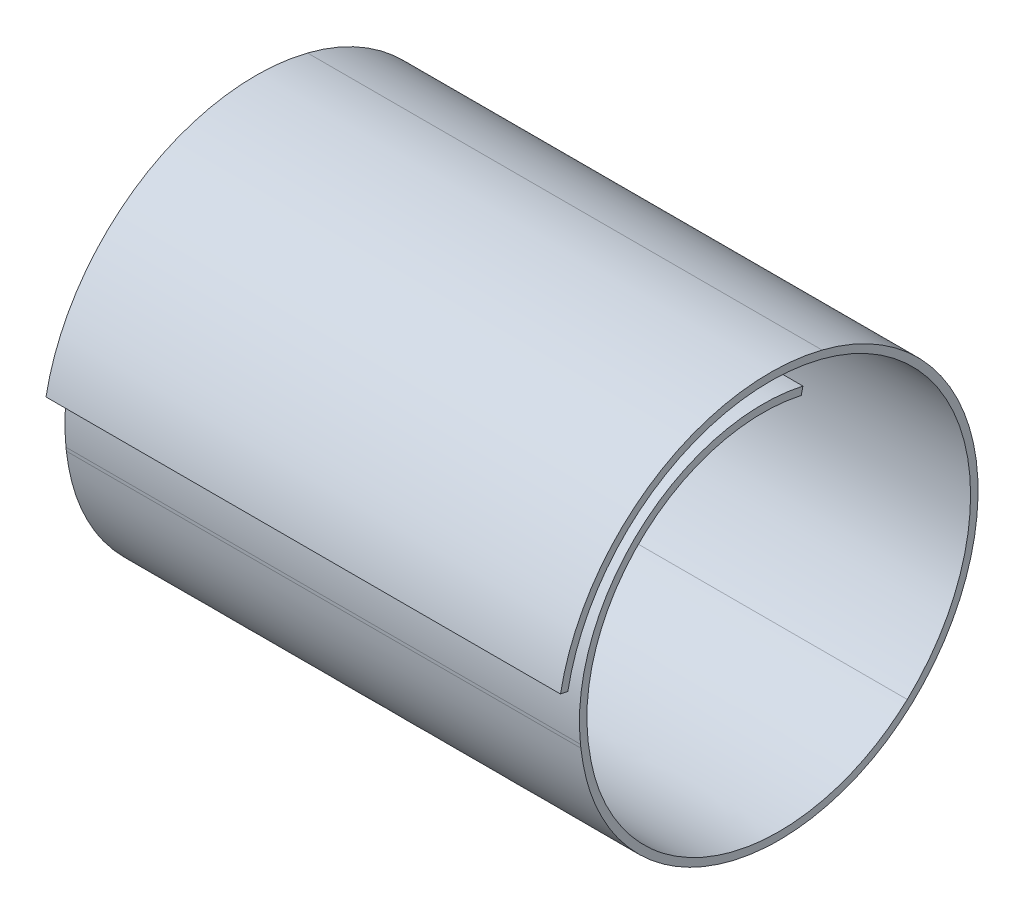
ISO-10303-21;
HEADER;
FILE_DESCRIPTION(('STEP AP214'),'2;1');
FILE_NAME('part.step','',(''),(''),'','','');
FILE_SCHEMA(('AUTOMOTIVE_DESIGN { 1 0 10303 214 1 1 1 1 }'));
ENDSEC;
DATA;
#1=APPLICATION_CONTEXT('core data for automotive mechanical design processes');
#2=APPLICATION_PROTOCOL_DEFINITION('international standard','automotive_design',2000,#1);
#3=PRODUCT_CONTEXT('',#1,'mechanical');
#4=PRODUCT('Part','Part','',(#3));
#5=PRODUCT_RELATED_PRODUCT_CATEGORY('part','',(#4));
#6=PRODUCT_DEFINITION_FORMATION('','',#4);
#7=PRODUCT_DEFINITION_CONTEXT('part definition',#1,'design');
#8=PRODUCT_DEFINITION('design','',#6,#7);
#9=PRODUCT_DEFINITION_SHAPE('','',#8);
#10=(LENGTH_UNIT() NAMED_UNIT(*) SI_UNIT(.MILLI.,.METRE.));
#11=(NAMED_UNIT(*) PLANE_ANGLE_UNIT() SI_UNIT($,.RADIAN.));
#12=(NAMED_UNIT(*) SI_UNIT($,.STERADIAN.) SOLID_ANGLE_UNIT());
#13=UNCERTAINTY_MEASURE_WITH_UNIT(LENGTH_MEASURE(1.E-05),#10,'distance_accuracy_value','');
#14=(GEOMETRIC_REPRESENTATION_CONTEXT(3) GLOBAL_UNCERTAINTY_ASSIGNED_CONTEXT((#13)) GLOBAL_UNIT_ASSIGNED_CONTEXT((#10,
#11,#12)) REPRESENTATION_CONTEXT('',''));
#15=CARTESIAN_POINT('',(0.,0.,0.));
#16=DIRECTION('',(0.,0.,1.));
#17=DIRECTION('',(1.,0.,0.));
#18=AXIS2_PLACEMENT_3D('',#15,#16,#17);
#19=CARTESIAN_POINT('',(22.2834841720338,32.5817594490575,-1.39727762361172));
#20=DIRECTION('',(1.,0.,0.));
#21=DIRECTION('',(0.,0.249377833365716,-0.968406266102105));
#22=AXIS2_PLACEMENT_3D('',#19,#20,#21);
#23=PLANE('',#22);
#24=CARTESIAN_POINT('',(22.2834841720338,32.0777337419169,0.56));
#25=DIRECTION('',(1.,0.,0.));
#26=DIRECTION('',(0.,0.249377833365716,-0.968406266102105));
#27=AXIS2_PLACEMENT_3D('',#24,#25,#26);
#28=CIRCLE('',#27,0.55);
#29=CARTESIAN_POINT('',(22.2834841720338,32.6112860792963,0.426501298594451));
#30=VERTEX_POINT('',#29);
#31=CARTESIAN_POINT('',(22.2834841720338,31.6749898063342,0.185370130756026));
#32=VERTEX_POINT('',#31);
#33=EDGE_CURVE('E11',#30,#32,#28,.F.);
#34=ORIENTED_EDGE('',*,*,#33,.T.);
#35=CARTESIAN_POINT('',(22.2834841720338,31.6749555199502,0.185339989653486));
#36=CARTESIAN_POINT('',(22.2834841720338,31.6698808621695,0.191012355613164));
#37=CARTESIAN_POINT('',(22.2834841720338,31.6648791742821,0.196751024358772));
#38=CARTESIAN_POINT('',(22.2834841720338,31.6550659642576,0.208393307895752));
#39=CARTESIAN_POINT('',(22.2834841720338,31.6502545398912,0.214297004897411));
#40=CARTESIAN_POINT('',(22.2834841720338,31.63618160218,0.232293075514867));
#41=CARTESIAN_POINT('',(22.2834841720338,31.6272793506486,0.244672680977374));
#42=CARTESIAN_POINT('',(22.2834841720338,31.6106773176507,0.270201987780066));
#43=CARTESIAN_POINT('',(22.2834841720338,31.6029766910361,0.283351138837553));
#44=CARTESIAN_POINT('',(22.2834841720338,31.5887690090579,0.310270247267101));
#45=CARTESIAN_POINT('',(22.2834841720338,31.5822617952751,0.324040121938613));
#46=CARTESIAN_POINT('',(22.2834841720338,31.5645509470875,0.366217417705972));
#47=CARTESIAN_POINT('',(22.2834841720338,31.5551995971211,0.395428061956361));
#48=CARTESIAN_POINT('',(22.2834841720338,31.5416568440759,0.454995892258565));
#49=CARTESIAN_POINT('',(22.2834841720338,31.5374638957613,0.485352732149487));
#50=CARTESIAN_POINT('',(22.2834841720338,31.5344775086547,0.54543933930613));
#51=CARTESIAN_POINT('',(22.2834841720338,31.5355289374535,0.575161300786628));
#52=CARTESIAN_POINT('',(22.2834841720338,31.5426069670161,0.634007862933464));
#53=CARTESIAN_POINT('',(22.2834841720338,31.5486342274763,0.663132383866301));
#54=CARTESIAN_POINT('',(22.2834841720338,31.565450483892,0.719893215268894));
#55=CARTESIAN_POINT('',(22.2834841720338,31.5762278726637,0.747532970274621));
#56=CARTESIAN_POINT('',(22.2834841720338,31.6022035456812,0.800650688975554));
#57=CARTESIAN_POINT('',(22.2834841720338,31.6174018825885,0.826128626914995));
#58=CARTESIAN_POINT('',(22.2834841720338,31.6520475525597,0.874485353006531));
#59=CARTESIAN_POINT('',(22.2834841720338,31.671544104786,0.897328935122091));
#60=CARTESIAN_POINT('',(22.2834841720338,31.7141097676822,0.939408236840575));
#61=CARTESIAN_POINT('',(22.2834841720338,31.7371799151115,0.958642905845451));
#62=CARTESIAN_POINT('',(22.2834841720338,31.7862010846961,0.993091464107349));
#63=CARTESIAN_POINT('',(22.2834841720338,31.8121573684555,1.00829783307192));
#64=CARTESIAN_POINT('',(22.2834841720338,31.8662539140428,1.03416566235308));
#65=CARTESIAN_POINT('',(22.2834841720338,31.8943921679861,1.0448312438594));
#66=CARTESIAN_POINT('',(22.2834841720338,31.9379021349199,1.05701358314625));
#67=CARTESIAN_POINT('',(22.2834841720338,31.9527621090303,1.06045145471141));
#68=CARTESIAN_POINT('',(22.2834841720338,31.9826703304152,1.06622344208677));
#69=CARTESIAN_POINT('',(22.2834841720338,31.9977181886181,1.06855954269358));
#70=CARTESIAN_POINT('',(22.2834841720338,32.0128022203996,1.07047103077814));
#71=B_SPLINE_CURVE_WITH_KNOTS('',3,(#35,#36,#37,#38,#39,#40,#41,#42,#43,#44,#45,#46,#47,#48,#49,
#50,#51,#52,#53,#54,#55,#56,#57,#58,#59,#60,#61,#62,#63,#64,#65,#66,#67,#68,#69,#70),
.UNSPECIFIED.,.F.,.F.,(4,2,2,2,2,2,2,2,2,2,2,2,2,2,2,2,2,4),(0.,0.0228330582740365,
0.045677701196849,0.0913578260237418,0.137005676057433,0.182647462186725,0.274157819941521,
0.365640758440238,0.454433902441009,0.543238820539437,0.631827932008516,0.720418098775036,
0.810080925523775,0.899769813838889,0.989624977707331,1.07939841484562,1.12511416775738,
1.17074724798271),.UNSPECIFIED.);
#72=CARTESIAN_POINT('',(22.2834841720338,32.0128085285747,1.07042176268635));
#73=VERTEX_POINT('',#72);
#74=EDGE_CURVE('E270',#32,#73,#71,.T.);
#75=ORIENTED_EDGE('',*,*,#74,.T.);
#76=CARTESIAN_POINT('',(22.2834841720338,32.0128150240828,1.07037252638147));
#77=CARTESIAN_POINT('',(22.2834841720338,32.0159557298064,1.07071470129051));
#78=CARTESIAN_POINT('',(22.2834841720338,32.01909643553,1.07105687619956));
#79=CARTESIAN_POINT('',(22.2834841720338,32.0222371412536,1.07139905110861));
#80=B_SPLINE_CURVE_WITH_KNOTS('',3,(#76,#77,#78,#79),.UNSPECIFIED.,.F.,.F.,(4,4),(0.,1.),.UNSPECIFIED.);
#81=CARTESIAN_POINT('',(22.2834843387005,32.0222369755674,1.07139903305735));
#82=VERTEX_POINT('',#81);
#83=EDGE_CURVE('E189',#73,#82,#80,.T.);
#84=ORIENTED_EDGE('',*,*,#83,.T.);
#85=CARTESIAN_POINT('',(22.2834841720338,32.0753078344884,0.584281423276168));
#86=DIRECTION('',(1.,0.,0.));
#87=DIRECTION('',(0.,0.782950168785445,0.622084426102152));
#88=AXIS2_PLACEMENT_3D('',#85,#86,#87);
#89=CIRCLE('',#88,0.49);
#90=CARTESIAN_POINT('',(22.2834841720338,32.5535587850281,0.477622957565097));
#91=VERTEX_POINT('',#90);
#92=EDGE_CURVE('E391',#82,#91,#89,.F.);
#93=ORIENTED_EDGE('',*,*,#92,.T.);
#94=CARTESIAN_POINT('',(22.2834841720338,32.5340383380673,0.481976364328814));
#95=CARTESIAN_POINT('',(22.2834841720338,32.5405451537209,0.480525228740909));
#96=CARTESIAN_POINT('',(22.2834841720338,32.5470519693745,0.479074093153006));
#97=CARTESIAN_POINT('',(22.2834841720338,32.5535587850281,0.477622957565097));
#98=B_SPLINE_CURVE_WITH_KNOTS('',3,(#94,#95,#96,#97),.UNSPECIFIED.,.F.,.F.,(4,4),(0.,1.),.UNSPECIFIED.);
#99=CARTESIAN_POINT('',(22.2834844220338,32.5340383380673,0.481976364328814));
#100=VERTEX_POINT('',#99);
#101=EDGE_CURVE('E396',#100,#91,#98,.T.);
#102=ORIENTED_EDGE('',*,*,#101,.F.);
#103=CARTESIAN_POINT('',(22.2834841720338,32.0753078344884,0.584281423276168));
#104=DIRECTION('',(1.,0.,0.));
#105=DIRECTION('',(0.,0.782950168785445,0.622084426102152));
#106=AXIS2_PLACEMENT_3D('',#103,#104,#105);
#107=CIRCLE('',#106,0.47);
#108=CARTESIAN_POINT('',(22.2834841720338,32.0244032735784,1.05151686801847));
#109=VERTEX_POINT('',#108);
#110=EDGE_CURVE('E380',#109,#100,#107,.F.);
#111=ORIENTED_EDGE('',*,*,#110,.F.);
#112=CARTESIAN_POINT('',(22.2834841720338,32.0146341267692,1.05045236731752));
#113=CARTESIAN_POINT('',(22.2834841720338,32.0178905150558,1.05080714565839));
#114=CARTESIAN_POINT('',(22.2834841720338,32.0211469033423,1.05116192399925));
#115=CARTESIAN_POINT('',(22.2834841720338,32.0244032916288,1.05151670234011));
#116=B_SPLINE_CURVE_WITH_KNOTS('',3,(#112,#113,#114,#115),.UNSPECIFIED.,.F.,.F.,(4,4),(0.,1.),.UNSPECIFIED.);
#117=CARTESIAN_POINT('',(22.2834841720338,32.0146281301622,1.05049788347525));
#118=VERTEX_POINT('',#117);
#119=EDGE_CURVE('E171',#118,#109,#116,.T.);
#120=ORIENTED_EDGE('',*,*,#119,.F.);
#121=CARTESIAN_POINT('',(22.2834841720338,31.689612803697,0.198955729521763));
#122=CARTESIAN_POINT('',(22.2834841720338,31.6847336601493,0.20440555265611));
#123=CARTESIAN_POINT('',(22.2834841720338,31.6799229697497,0.209917971215753));
#124=CARTESIAN_POINT('',(22.2834841720338,31.6704850843375,0.221101878385132));
#125=CARTESIAN_POINT('',(22.2834841720338,31.6658579793595,0.226773442771875));
#126=CARTESIAN_POINT('',(22.2834841720338,31.652331705133,0.244066302985727));
#127=CARTESIAN_POINT('',(22.2834841720338,31.6437846176428,0.255968968828372));
#128=CARTESIAN_POINT('',(22.2834841720338,31.6278422718934,0.28050921325994));
#129=CARTESIAN_POINT('',(22.2834841720338,31.6204461369596,0.293146222326122));
#130=CARTESIAN_POINT('',(22.2834841720338,31.6067891477932,0.319012427695709));
#131=CARTESIAN_POINT('',(22.2834841720338,31.6005282363531,0.332241594116433));
#132=CARTESIAN_POINT('',(22.2834841720338,31.5834830157649,0.372764355323607));
#133=CARTESIAN_POINT('',(22.2834841720338,31.574476356244,0.400830931621634));
#134=CARTESIAN_POINT('',(22.2834841720338,31.5614402520262,0.458072270953598));
#135=CARTESIAN_POINT('',(22.2834841720338,31.5574094328045,0.487246725651107));
#136=CARTESIAN_POINT('',(22.2834841720338,31.5545241532531,0.544935037793491));
#137=CARTESIAN_POINT('',(22.2834841720338,31.5555114288369,0.573440944271861));
#138=CARTESIAN_POINT('',(22.2834841720338,31.5622365029683,0.629926321896197));
#139=CARTESIAN_POINT('',(22.2834841720338,31.5679810601765,0.657904986117068));
#140=CARTESIAN_POINT('',(22.2834841720338,31.5840735105387,0.712527069755707));
#141=CARTESIAN_POINT('',(22.2834841720338,31.5944248208265,0.739169481633073));
#142=CARTESIAN_POINT('',(22.2834841720338,31.6193998134761,0.790366212943047));
#143=CARTESIAN_POINT('',(22.2834841720338,31.6340231877667,0.814920682778638));
#144=CARTESIAN_POINT('',(22.2834841720338,31.6673367119266,0.861507610466049));
#145=CARTESIAN_POINT('',(22.2834841720338,31.6860695517594,0.883509579870706));
#146=CARTESIAN_POINT('',(22.2834841720338,31.7269425866779,0.924021281961485));
#147=CARTESIAN_POINT('',(22.2834841720338,31.7490785081434,0.942535330793605));
#148=CARTESIAN_POINT('',(22.2834841720338,31.7961811543727,0.97572428543135));
#149=CARTESIAN_POINT('',(22.2834841720338,31.8211586388741,0.990383852596585));
#150=CARTESIAN_POINT('',(22.2834841720338,31.8732117068689,1.01534684127488));
#151=CARTESIAN_POINT('',(22.2834841720338,31.9002854766614,1.0256539797462));
#152=CARTESIAN_POINT('',(22.2834841720338,31.942214655206,1.03747723103188));
#153=CARTESIAN_POINT('',(22.2834841720338,31.9565768782218,1.04082803809299));
#154=CARTESIAN_POINT('',(22.2834841720338,31.9854876204645,1.04644258178711));
#155=CARTESIAN_POINT('',(22.2834841720338,32.0000357448822,1.04870832254806));
#156=CARTESIAN_POINT('',(22.2834841720338,32.0146222989028,1.0505434201971));
#157=B_SPLINE_CURVE_WITH_KNOTS('',3,(#121,#122,#123,#124,#125,#126,#127,#128,#129,#130,#131,
#132,#133,#134,#135,#136,#137,#138,#139,#140,#141,#142,#143,#144,#145,#146,#147,#148,#149,#150,
#151,#152,#153,#154,#155,#156),.UNSPECIFIED.,.F.,.F.,(4,2,2,2,2,2,2,2,2,2,2,2,2,2,2,2,2,4),(0.,
0.0219448502578412,0.0439003330174963,0.0877982517423902,0.131662568231541,0.175524673638027,
0.263468125582214,0.351387278611099,0.436551115885536,0.52183615324023,0.607184557868231,
0.692526809285057,0.778801557396353,0.864968832836049,0.951473985758361,1.03790511345535,
1.08210746755155,1.12622786155224),.UNSPECIFIED.);
#158=CARTESIAN_POINT('',(22.2834841720338,31.6896362433948,0.198993591413968));
#159=VERTEX_POINT('',#158);
#160=EDGE_CURVE('E257',#159,#118,#157,.T.);
#161=ORIENTED_EDGE('',*,*,#160,.F.);
#162=CARTESIAN_POINT('',(22.2834841720338,32.0777337419169,0.56));
#163=DIRECTION('',(1.,0.,0.));
#164=DIRECTION('',(0.,0.249377833365716,-0.968406266102105));
#165=AXIS2_PLACEMENT_3D('',#162,#163,#164);
#166=CIRCLE('',#165,0.53);
#167=CARTESIAN_POINT('',(22.2834841720338,32.591884419122,0.431355736026203));
#168=VERTEX_POINT('',#167);
#169=EDGE_CURVE('E64',#168,#159,#166,.F.);
#170=ORIENTED_EDGE('',*,*,#169,.F.);
#171=CARTESIAN_POINT('',(22.2834841720338,32.0583318387619,0.564854498227317));
#172=DIRECTION('',(1.,0.,0.));
#173=DIRECTION('',(0.,0.814602386089999,0.580019786366362));
#174=AXIS2_PLACEMENT_3D('',#171,#172,#173);
#175=CIRCLE('',#174,0.55);
#176=CARTESIAN_POINT('',(22.2834841720338,32.1613807466414,1.10511454911471));
#177=VERTEX_POINT('',#176);
#178=EDGE_CURVE('E152',#177,#168,#175,.F.);
#179=ORIENTED_EDGE('',*,*,#178,.F.);
#180=CARTESIAN_POINT('',(22.2834841720338,32.1613807466414,1.10511454911471));
#181=CARTESIAN_POINT('',(22.2834841720338,32.1626298243126,1.11166315579218));
#182=CARTESIAN_POINT('',(22.2834841720338,32.1638789019839,1.11821176246953));
#183=CARTESIAN_POINT('',(22.2834841720338,32.1651279796552,1.12476036914697));
#184=B_SPLINE_CURVE_WITH_KNOTS('',3,(#180,#181,#182,#183),.UNSPECIFIED.,.F.,.F.,(4,4),(0.,
2.E-05),.UNSPECIFIED.);
#185=CARTESIAN_POINT('',(22.2834841720338,32.1651279796552,1.12476036914697));
#186=VERTEX_POINT('',#185);
#187=EDGE_CURVE('E150',#177,#186,#184,.T.);
#188=ORIENTED_EDGE('',*,*,#187,.T.);
#189=CARTESIAN_POINT('',(22.2834841720338,32.0583318387619,0.564854498227317));
#190=DIRECTION('',(1.,0.,0.));
#191=DIRECTION('',(0.,0.814602386089999,0.580019786366362));
#192=AXIS2_PLACEMENT_3D('',#189,#190,#191);
#193=CIRCLE('',#192,0.57);
#194=EDGE_CURVE('E139',#186,#30,#193,.F.);
#195=ORIENTED_EDGE('',*,*,#194,.T.);
#196=EDGE_LOOP('',(#34,#75,#84,#93,#102,#111,#120,#161,#170,#179,#188,#195));
#197=FACE_BOUND('',#196,.T.);
#198=ADVANCED_FACE('F45',(#197),#23,.F.);
#199=CARTESIAN_POINT('',(23.6569362608721,31.576333585848,2.50708184929005));
#200=DIRECTION('',(1.,0.,0.));
#201=DIRECTION('',(0.,0.249377833365716,-0.968406266102105));
#202=AXIS2_PLACEMENT_3D('',#199,#200,#201);
#203=PLANE('',#202);
#204=CARTESIAN_POINT('',(23.6569362608721,32.0777337419169,0.56));
#205=DIRECTION('',(1.,0.,0.));
#206=DIRECTION('',(0.,0.249377833365716,-0.968406266102105));
#207=AXIS2_PLACEMENT_3D('',#204,#205,#206);
#208=CIRCLE('',#207,0.53);
#209=CARTESIAN_POINT('',(23.6569362608721,31.6896362433949,0.198993591413992));
#210=VERTEX_POINT('',#209);
#211=CARTESIAN_POINT('',(23.6569362608721,32.5918841761189,0.431355796827378));
#212=VERTEX_POINT('',#211);
#213=EDGE_CURVE('E56',#210,#212,#208,.T.);
#214=ORIENTED_EDGE('',*,*,#213,.F.);
#215=CARTESIAN_POINT('',(23.6569362608721,32.0146225468537,1.05054345194875));
#216=CARTESIAN_POINT('',(23.6569362608721,32.0071313689948,1.04958101969867));
#217=CARTESIAN_POINT('',(23.6569362608721,31.9996517424406,1.0485229792424));
#218=CARTESIAN_POINT('',(23.6569362608721,31.9847274643348,1.0461624410444));
#219=CARTESIAN_POINT('',(23.6569362608721,31.9772828330721,1.04485981601913));
#220=CARTESIAN_POINT('',(23.6569362608721,31.9550339824158,1.04050732136163));
#221=CARTESIAN_POINT('',(23.6569362608721,31.9403117673156,1.03701248594652));
#222=CARTESIAN_POINT('',(23.6569362608721,31.9112605904953,1.02866056189237));
#223=CARTESIAN_POINT('',(23.6569362608721,31.896931560437,1.02380371164791));
#224=CARTESIAN_POINT('',(23.6569362608721,31.8687660896442,1.01284439662159));
#225=CARTESIAN_POINT('',(23.6569362608721,31.8549296084438,1.00674203444478));
#226=CARTESIAN_POINT('',(23.6569362608721,31.8142105720938,0.986595982054203));
#227=CARTESIAN_POINT('',(23.6569362608721,31.7881994805824,0.970737014914492));
#228=CARTESIAN_POINT('',(23.6569362608721,31.7393475472495,0.934761226504578));
#229=CARTESIAN_POINT('',(23.6569362608721,31.7165051801357,0.914646465654118));
#230=CARTESIAN_POINT('',(23.6569362608721,31.6755879834309,0.871548453723236));
#231=CARTESIAN_POINT('',(23.6569362608721,31.6573596750748,0.848711100846284));
#232=CARTESIAN_POINT('',(23.6569362608721,31.6250405273983,0.800275083581147));
#233=CARTESIAN_POINT('',(23.6569362608721,31.6109500778657,0.774676159362399));
#234=CARTESIAN_POINT('',(23.6569362608721,31.5874719149764,0.72180270757544));
#235=CARTESIAN_POINT('',(23.6569362608721,31.5780255721804,0.694554221693799));
#236=CARTESIAN_POINT('',(23.6569362608721,31.5638722110155,0.63885507027403));
#237=CARTESIAN_POINT('',(23.6569362608721,31.5591645322949,0.610404572816892));
#238=CARTESIAN_POINT('',(23.6569362608721,31.5546385648387,0.553214671541562));
#239=CARTESIAN_POINT('',(23.6569362608721,31.5548037472893,0.524476574853853));
#240=CARTESIAN_POINT('',(23.6569362608721,31.5599951693226,0.46744454585484));
#241=CARTESIAN_POINT('',(23.6569362608721,31.5650207416896,0.439150553120406));
#242=CARTESIAN_POINT('',(23.6569362608721,31.5797278252537,0.383970356372632));
#243=CARTESIAN_POINT('',(23.6569362608721,31.5893844458516,0.357077468701239));
#244=CARTESIAN_POINT('',(23.6569362608721,31.6131021017867,0.305305834291584));
#245=CARTESIAN_POINT('',(23.6569362608721,31.6271583401041,0.280424930836879));
#246=CARTESIAN_POINT('',(23.6569362608721,31.6503565792303,0.246827212339497));
#247=CARTESIAN_POINT('',(23.6569362608721,31.657802312192,0.236904740042403));
#248=CARTESIAN_POINT('',(23.6569362608721,31.6732974308587,0.217571134457194));
#249=CARTESIAN_POINT('',(23.6569362608721,31.6813456482391,0.208159069564563));
#250=CARTESIAN_POINT('',(23.6569362608721,31.6896126983223,0.198955847142111));
#251=B_SPLINE_CURVE_WITH_KNOTS('',3,(#215,#216,#217,#218,#219,#220,#221,#222,#223,#224,#225,
#226,#227,#228,#229,#230,#231,#232,#233,#234,#235,#236,#237,#238,#239,#240,#241,#242,#243,#244,
#245,#246,#247,#248,#249,#250),.UNSPECIFIED.,.F.,.F.,(4,2,2,2,2,2,2,2,2,2,2,2,2,2,2,2,2,4),(0.,
0.0226581640643217,0.0453281524435603,0.0906589763575372,0.135981870926543,0.181301033309154,
0.272189195921178,0.363033455797144,0.450264762666705,0.537504284120404,0.623612203195223,
0.709708121129149,0.795512034181931,0.881304170072077,0.966640278572082,1.05188366507497,
1.08907577788888,1.12619754911163),.UNSPECIFIED.);
#252=CARTESIAN_POINT('',(23.6569362608721,32.0146283783759,1.05049791306769));
#253=VERTEX_POINT('',#252);
#254=EDGE_CURVE('E195',#253,#210,#251,.T.);
#255=ORIENTED_EDGE('',*,*,#254,.F.);
#256=CARTESIAN_POINT('',(23.6569362608721,32.0244032916288,1.05151670234011));
#257=CARTESIAN_POINT('',(23.6569362608721,32.0211469033423,1.05116192399925));
#258=CARTESIAN_POINT('',(23.6569362608721,32.0178905150558,1.05080714565839));
#259=CARTESIAN_POINT('',(23.6569362608721,32.0146341267692,1.05045236731752));
#260=B_SPLINE_CURVE_WITH_KNOTS('',3,(#256,#257,#258,#259),.UNSPECIFIED.,.F.,.F.,(4,4),(0.,1.),.UNSPECIFIED.);
#261=CARTESIAN_POINT('',(23.6569362608721,32.0244032916288,1.05151670234011));
#262=VERTEX_POINT('',#261);
#263=EDGE_CURVE('E173',#262,#253,#260,.T.);
#264=ORIENTED_EDGE('',*,*,#263,.F.);
#265=CARTESIAN_POINT('',(23.6569362608721,32.0753078344884,0.584281423276168));
#266=DIRECTION('',(1.,0.,0.));
#267=DIRECTION('',(0.,0.782950168785445,0.622084426102152));
#268=AXIS2_PLACEMENT_3D('',#265,#266,#267);
#269=CIRCLE('',#268,0.47);
#270=CARTESIAN_POINT('',(23.6569362608721,32.5340383380673,0.48197636432881));
#271=VERTEX_POINT('',#270);
#272=EDGE_CURVE('E388',#271,#262,#269,.T.);
#273=ORIENTED_EDGE('',*,*,#272,.F.);
#274=CARTESIAN_POINT('',(23.6569362608721,32.5535587850281,0.477622957565094));
#275=CARTESIAN_POINT('',(23.6569362608721,32.5470519693745,0.479074093153014));
#276=CARTESIAN_POINT('',(23.6569362608721,32.5405451537209,0.4805252287409));
#277=CARTESIAN_POINT('',(23.6569362608721,32.5340383380673,0.48197636432881));
#278=B_SPLINE_CURVE_WITH_KNOTS('',3,(#274,#275,#276,#277),.UNSPECIFIED.,.F.,.F.,(4,4),(-2.E-05,
0.),.UNSPECIFIED.);
#279=CARTESIAN_POINT('',(23.6569362608721,32.5535587850281,0.477622957565094));
#280=VERTEX_POINT('',#279);
#281=EDGE_CURVE('E184',#271,#280,#278,.F.);
#282=ORIENTED_EDGE('',*,*,#281,.T.);
#283=CARTESIAN_POINT('',(23.6569362608721,32.0753078344884,0.584281423276168));
#284=DIRECTION('',(1.,0.,0.));
#285=DIRECTION('',(0.,0.782950168785445,0.622084426102152));
#286=AXIS2_PLACEMENT_3D('',#283,#284,#285);
#287=CIRCLE('',#286,0.49);
#288=CARTESIAN_POINT('',(23.6569362608721,32.0222369755674,1.07139903305735));
#289=VERTEX_POINT('',#288);
#290=EDGE_CURVE('E326',#289,#280,#287,.F.);
#291=ORIENTED_EDGE('',*,*,#290,.F.);
#292=CARTESIAN_POINT('',(23.6569362608721,32.0128150240828,1.07037252638147));
#293=CARTESIAN_POINT('',(23.6569362608721,32.0159557298064,1.07071470129051));
#294=CARTESIAN_POINT('',(23.6569362608721,32.01909643553,1.07105687619956));
#295=CARTESIAN_POINT('',(23.6569362608721,32.0222371412536,1.07139905110861));
#296=B_SPLINE_CURVE_WITH_KNOTS('',3,(#292,#293,#294,#295),.UNSPECIFIED.,.F.,.F.,(4,4),(0.,1.),.UNSPECIFIED.);
#297=CARTESIAN_POINT('',(23.6569362608721,32.0128085285747,1.07042176268638));
#298=VERTEX_POINT('',#297);
#299=EDGE_CURVE('E319',#298,#289,#296,.T.);
#300=ORIENTED_EDGE('',*,*,#299,.F.);
#301=CARTESIAN_POINT('',(23.6569362608721,31.6749555199503,0.185339989653518));
#302=CARTESIAN_POINT('',(23.6569362608721,31.6698808621696,0.191012355613193));
#303=CARTESIAN_POINT('',(23.6569362608721,31.6648791742821,0.1967510243588));
#304=CARTESIAN_POINT('',(23.6569362608721,31.6550659642577,0.208393307895783));
#305=CARTESIAN_POINT('',(23.6569362608721,31.6502545398913,0.214297004897445));
#306=CARTESIAN_POINT('',(23.6569362608721,31.63618160218,0.232293075514896));
#307=CARTESIAN_POINT('',(23.6569362608721,31.6272793506486,0.244672680977388));
#308=CARTESIAN_POINT('',(23.6569362608721,31.6106773176507,0.270201987780075));
#309=CARTESIAN_POINT('',(23.6569362608721,31.602976691036,0.283351138837574));
#310=CARTESIAN_POINT('',(23.6569362608721,31.5887690090578,0.310270247267143));
#311=CARTESIAN_POINT('',(23.6569362608721,31.582261795275,0.324040121938665));
#312=CARTESIAN_POINT('',(23.6569362608721,31.5645509470874,0.366217417706049));
#313=CARTESIAN_POINT('',(23.6569362608721,31.5551995971211,0.395428061956451));
#314=CARTESIAN_POINT('',(23.6569362608721,31.5416568440759,0.454995892258683));
#315=CARTESIAN_POINT('',(23.6569362608721,31.5374638957613,0.485352732149621));
#316=CARTESIAN_POINT('',(23.6569362608721,31.5344775086547,0.545439339306328));
#317=CARTESIAN_POINT('',(23.6569362608721,31.5355289374535,0.575161300786875));
#318=CARTESIAN_POINT('',(23.6569362608721,31.5426069670161,0.634007862933811));
#319=CARTESIAN_POINT('',(23.6569362608721,31.5486342274764,0.663132383866696));
#320=CARTESIAN_POINT('',(23.6569362608721,31.5654504838921,0.719893215269326));
#321=CARTESIAN_POINT('',(23.6569362608721,31.5762278726639,0.747532970275043));
#322=CARTESIAN_POINT('',(23.6569362608721,31.6022035456815,0.800650688975963));
#323=CARTESIAN_POINT('',(23.6569362608721,31.6174018825887,0.8261286269154));
#324=CARTESIAN_POINT('',(23.6569362608721,31.65204755256,0.874485353006931));
#325=CARTESIAN_POINT('',(23.6569362608721,31.6715441047864,0.897328935122489));
#326=CARTESIAN_POINT('',(23.6569362608721,31.7141097676826,0.939408236840947));
#327=CARTESIAN_POINT('',(23.6569362608721,31.7371799151119,0.958642905845797));
#328=CARTESIAN_POINT('',(23.6569362608721,31.7862010846965,0.993091464107602));
#329=CARTESIAN_POINT('',(23.6569362608721,31.8121573684559,1.00829783307211));
#330=CARTESIAN_POINT('',(23.6569362608721,31.8662539140432,1.0341656623532));
#331=CARTESIAN_POINT('',(23.6569362608721,31.8943921679864,1.0448312438595));
#332=CARTESIAN_POINT('',(23.6569362608721,31.9379021349202,1.05701358314634));
#333=CARTESIAN_POINT('',(23.6569362608721,31.9527621090305,1.0604514547115));
#334=CARTESIAN_POINT('',(23.6569362608721,31.9826703304153,1.06622344208685));
#335=CARTESIAN_POINT('',(23.6569362608721,31.9977181886181,1.06855954269366));
#336=CARTESIAN_POINT('',(23.6569362608721,32.0128022203996,1.0704710307782));
#337=B_SPLINE_CURVE_WITH_KNOTS('',3,(#301,#302,#303,#304,#305,#306,#307,#308,#309,#310,#311,
#312,#313,#314,#315,#316,#317,#318,#319,#320,#321,#322,#323,#324,#325,#326,#327,#328,#329,#330,
#331,#332,#333,#334,#335,#336),.UNSPECIFIED.,.F.,.F.,(4,2,2,2,2,2,2,2,2,2,2,2,2,2,2,2,2,4),(0.,
0.0228330582740425,0.0456777011968664,0.0913578260237786,0.137005676057491,0.182647462186803,
0.274157819941633,0.365640758440392,0.454433902441315,0.543238820539894,0.631827932008982,
0.720418098775525,0.810080925524309,0.899769813839457,0.989624977707764,1.07939841484591,
1.12511416775754,1.17074724798272),.UNSPECIFIED.);
#338=CARTESIAN_POINT('',(23.6569362608721,31.6749898063342,0.185370130756042));
#339=VERTEX_POINT('',#338);
#340=EDGE_CURVE('E269',#339,#298,#337,.T.);
#341=ORIENTED_EDGE('',*,*,#340,.F.);
#342=CARTESIAN_POINT('',(23.6569362608721,32.0777337419169,0.56));
#343=DIRECTION('',(1.,0.,0.));
#344=DIRECTION('',(0.,0.249377833365716,-0.968406266102105));
#345=AXIS2_PLACEMENT_3D('',#342,#343,#344);
#346=CIRCLE('',#345,0.55);
#347=CARTESIAN_POINT('',(23.6569362608721,32.6112860792963,0.426501298594451));
#348=VERTEX_POINT('',#347);
#349=EDGE_CURVE('E77',#348,#339,#346,.F.);
#350=ORIENTED_EDGE('',*,*,#349,.F.);
#351=CARTESIAN_POINT('',(23.6569362608721,32.0583318387619,0.564854498227317));
#352=DIRECTION('',(1.,0.,0.));
#353=DIRECTION('',(0.,0.814602386089999,0.580019786366362));
#354=AXIS2_PLACEMENT_3D('',#351,#352,#353);
#355=CIRCLE('',#354,0.57);
#356=CARTESIAN_POINT('',(23.6569362608721,32.1651279796552,1.12476036914697));
#357=VERTEX_POINT('',#356);
#358=EDGE_CURVE('E147',#357,#348,#355,.F.);
#359=ORIENTED_EDGE('',*,*,#358,.F.);
#360=CARTESIAN_POINT('',(23.6569362608721,32.1613807466414,1.10511454911471));
#361=CARTESIAN_POINT('',(23.6569362608721,32.1626298243126,1.11166315579218));
#362=CARTESIAN_POINT('',(23.6569362608721,32.1638789019839,1.11821176246953));
#363=CARTESIAN_POINT('',(23.6569362608721,32.1651279796552,1.12476036914697));
#364=B_SPLINE_CURVE_WITH_KNOTS('',3,(#360,#361,#362,#363),.UNSPECIFIED.,.F.,.F.,(4,4),(0.,
2.E-05),.UNSPECIFIED.);
#365=CARTESIAN_POINT('',(23.6569362608721,32.1613807466414,1.10511454911471));
#366=VERTEX_POINT('',#365);
#367=EDGE_CURVE('E156',#357,#366,#364,.F.);
#368=ORIENTED_EDGE('',*,*,#367,.T.);
#369=CARTESIAN_POINT('',(23.6569362608721,32.0583318387619,0.564854498227317));
#370=DIRECTION('',(1.,0.,0.));
#371=DIRECTION('',(0.,0.814602386089999,0.580019786366362));
#372=AXIS2_PLACEMENT_3D('',#369,#370,#371);
#373=CIRCLE('',#372,0.55);
#374=EDGE_CURVE('E169',#212,#366,#373,.T.);
#375=ORIENTED_EDGE('',*,*,#374,.F.);
#376=EDGE_LOOP('',(#214,#255,#264,#273,#282,#291,#300,#341,#350,#359,#368,#375));
#377=FACE_BOUND('',#376,.T.);
#378=ADVANCED_FACE('F324',(#377),#203,.T.);
#379=CARTESIAN_POINT('',(22.2834841715667,32.0777337419169,0.56));
#380=DIRECTION('',(1.,0.,0.));
#381=DIRECTION('',(0.,0.968406266102103,0.249377833365726));
#382=AXIS2_PLACEMENT_3D('',#379,#380,#381);
#383=CYLINDRICAL_SURFACE('',#382,0.53);
#384=CARTESIAN_POINT('',(23.7942814697559,31.6896049566283,0.198964488615709));
#385=CARTESIAN_POINT('',(23.244900634221,31.6896049566282,0.198964488615482));
#386=CARTESIAN_POINT('',(22.6955197986849,31.6896049566284,0.198964488615983));
#387=CARTESIAN_POINT('',(22.1461389631502,31.6896049566282,0.198964488615494));
#388=B_SPLINE_CURVE_WITH_KNOTS('',3,(#384,#385,#386,#387),.UNSPECIFIED.,.F.,.F.,(4,4),
(0.02214613896315,0.023794281469756),.UNSPECIFIED.);
#389=EDGE_CURVE('E328',#210,#159,#388,.T.);
#390=ORIENTED_EDGE('',*,*,#389,.F.);
#391=ORIENTED_EDGE('',*,*,#213,.T.);
#392=DIRECTION('',(1.,0.,0.));
#393=VECTOR('',#392,1.);
#394=CARTESIAN_POINT('',(23.8615664419416,32.5918841761413,0.431355796821773));
#395=LINE('',#394,#393);
#396=EDGE_CURVE('E160',#212,#168,#395,.F.);
#397=ORIENTED_EDGE('',*,*,#396,.T.);
#398=ORIENTED_EDGE('',*,*,#169,.T.);
#399=EDGE_LOOP('',(#390,#391,#397,#398));
#400=FACE_BOUND('',#399,.T.);
#401=ADVANCED_FACE('F419',(#400),#383,.F.);
#402=CARTESIAN_POINT('',(22.2834841715667,32.0777337419169,0.56));
#403=DIRECTION('',(1.,0.,0.));
#404=DIRECTION('',(0.,0.968406266102103,0.249377833365726));
#405=AXIS2_PLACEMENT_3D('',#402,#403,#404);
#406=CYLINDRICAL_SURFACE('',#405,0.55);
#407=ORIENTED_EDGE('',*,*,#349,.T.);
#408=CARTESIAN_POINT('',(22.14613896315,31.6749566610453,0.185338715194003));
#409=CARTESIAN_POINT('',(22.6955197986853,31.6749566610454,0.185338715194431));
#410=CARTESIAN_POINT('',(23.2449006342206,31.6749566610453,0.185338715194044));
#411=CARTESIAN_POINT('',(23.794281469756,31.6749566610453,0.185338715194169));
#412=B_SPLINE_CURVE_WITH_KNOTS('',3,(#408,#409,#410,#411),.UNSPECIFIED.,.F.,.F.,(4,4),
(0.02214613896315,0.0237942814697559),.UNSPECIFIED.);
#413=EDGE_CURVE('E362',#339,#32,#412,.F.);
#414=ORIENTED_EDGE('',*,*,#413,.T.);
#415=ORIENTED_EDGE('',*,*,#33,.F.);
#416=DIRECTION('',(1.,0.,0.));
#417=VECTOR('',#416,1.);
#418=CARTESIAN_POINT('',(22.2834841715667,32.6112860793187,0.42650129858884));
#419=LINE('',#418,#417);
#420=EDGE_CURVE('E145',#348,#30,#419,.F.);
#421=ORIENTED_EDGE('',*,*,#420,.F.);
#422=EDGE_LOOP('',(#407,#414,#415,#421));
#423=FACE_BOUND('',#422,.T.);
#424=ADVANCED_FACE('F47',(#423),#406,.T.);
#425=CARTESIAN_POINT('',(22.2834841720338,32.5535587850281,0.477622957565097));
#426=DIRECTION('',(0.,0.217670338185752,0.9760223480403));
#427=DIRECTION('',(0.,-0.9760223480403,0.217670338185752));
#428=AXIS2_PLACEMENT_3D('',#425,#426,#427);
#429=PLANE('',#428);
#430=ORIENTED_EDGE('',*,*,#101,.T.);
#431=DIRECTION('',(1.,0.,0.));
#432=VECTOR('',#431,1.);
#433=CARTESIAN_POINT('',(22.2834841720338,32.5535587850281,0.477622957565097));
#434=LINE('',#433,#432);
#435=EDGE_CURVE('E395',#91,#280,#434,.T.);
#436=ORIENTED_EDGE('',*,*,#435,.T.);
#437=ORIENTED_EDGE('',*,*,#281,.F.);
#438=DIRECTION('',(1.,0.,0.));
#439=VECTOR('',#438,1.);
#440=CARTESIAN_POINT('',(22.2834841720338,32.5340383380673,0.481976364328814));
#441=LINE('',#440,#439);
#442=EDGE_CURVE('E390',#271,#100,#441,.F.);
#443=ORIENTED_EDGE('',*,*,#442,.T.);
#444=EDGE_LOOP('',(#430,#436,#437,#443));
#445=FACE_BOUND('',#444,.T.);
#446=ADVANCED_FACE('F426',(#445),#429,.F.);
#447=CARTESIAN_POINT('',(22.2834841715667,32.0753078344884,0.584281423276168));
#448=DIRECTION('',(1.,0.,0.));
#449=DIRECTION('',(0.,-0.62208442610216,0.782950168785439));
#450=AXIS2_PLACEMENT_3D('',#447,#448,#449);
#451=CYLINDRICAL_SURFACE('',#450,0.49);
#452=DIRECTION('',(1.,0.,0.));
#453=VECTOR('',#452,1.);
#454=CARTESIAN_POINT('',(23.93205417804,32.0222371502968,1.07139896810436));
#455=LINE('',#454,#453);
#456=EDGE_CURVE('E375',#289,#82,#455,.F.);
#457=ORIENTED_EDGE('',*,*,#456,.F.);
#458=ORIENTED_EDGE('',*,*,#290,.T.);
#459=ORIENTED_EDGE('',*,*,#435,.F.);
#460=ORIENTED_EDGE('',*,*,#92,.F.);
#461=EDGE_LOOP('',(#457,#458,#459,#460));
#462=FACE_BOUND('',#461,.T.);
#463=ADVANCED_FACE('F437',(#462),#451,.T.);
#464=CARTESIAN_POINT('',(22.2834841715667,32.0753078344884,0.584281423276168));
#465=DIRECTION('',(1.,0.,0.));
#466=DIRECTION('',(0.,-0.62208442610216,0.782950168785439));
#467=AXIS2_PLACEMENT_3D('',#464,#465,#466);
#468=CYLINDRICAL_SURFACE('',#467,0.47);
#469=DIRECTION('',(1.,0.,0.));
#470=VECTOR('',#469,1.);
#471=CARTESIAN_POINT('',(22.2834841715667,32.024403300672,1.05151661933586));
#472=LINE('',#471,#470);
#473=EDGE_CURVE('E372',#262,#109,#472,.F.);
#474=ORIENTED_EDGE('',*,*,#473,.T.);
#475=ORIENTED_EDGE('',*,*,#110,.T.);
#476=ORIENTED_EDGE('',*,*,#442,.F.);
#477=ORIENTED_EDGE('',*,*,#272,.T.);
#478=EDGE_LOOP('',(#474,#475,#476,#477));
#479=FACE_BOUND('',#478,.T.);
#480=ADVANCED_FACE('F278',(#479),#468,.F.);
#481=CARTESIAN_POINT('',(22.14613896315,32.1271362021547,1.08282909328337));
#482=CARTESIAN_POINT('',(22.1461389631492,32.0885886291676,1.07752549601188));
#483=CARTESIAN_POINT('',(22.1461389631507,32.0277040305912,1.07407235445978));
#484=CARTESIAN_POINT('',(22.1461389631497,31.9196557309833,1.05561187000883));
#485=CARTESIAN_POINT('',(22.1461389631498,31.7947698064456,1.00688380073488));
#486=CARTESIAN_POINT('',(22.1461389631503,31.6747941502782,0.911860717363907));
#487=CARTESIAN_POINT('',(22.1461389631497,31.5899685437464,0.787036778272162));
#488=CARTESIAN_POINT('',(22.1461389631506,31.5449804725299,0.666460516867326));
#489=CARTESIAN_POINT('',(22.1461389631495,31.5276608307142,0.517728487377607));
#490=CARTESIAN_POINT('',(22.1461389631503,31.5555871646538,0.370281752489278));
#491=CARTESIAN_POINT('',(22.14613896315,31.6165906123047,0.254843284588874));
#492=CARTESIAN_POINT('',(22.14613896315,31.6830464408149,0.173804017704707));
#493=CARTESIAN_POINT('',(22.1461389631499,31.7280199557795,0.130001610771428));
#494=CARTESIAN_POINT('',(22.14613896315,31.7533475257641,0.101197592802813));
#495=CARTESIAN_POINT('',(22.6955197986853,32.1271362021548,1.0828290932837));
#496=CARTESIAN_POINT('',(22.6955197986872,32.0885886291657,1.07752549600694));
#497=CARTESIAN_POINT('',(22.6955197986837,32.0277040305934,1.07407235446549));
#498=CARTESIAN_POINT('',(22.6955197986852,31.9196557309814,1.05561187000393));
#499=CARTESIAN_POINT('',(22.6955197986868,31.7947698064472,1.00688380073912));
#500=CARTESIAN_POINT('',(22.6955197986835,31.6747941502776,0.911860717362127));
#501=CARTESIAN_POINT('',(22.6955197986869,31.5899685437466,0.787036778272708));
#502=CARTESIAN_POINT('',(22.6955197986832,31.5449804725299,0.666460516867202));
#503=CARTESIAN_POINT('',(22.6955197986869,31.5276608307138,0.517728487376731));
#504=CARTESIAN_POINT('',(22.6955197986845,31.5555871646539,0.370281752489581));
#505=CARTESIAN_POINT('',(22.6955197986848,31.616590612304,0.254843284586944));
#506=CARTESIAN_POINT('',(22.6955197986855,31.6830464408157,0.17380401770666));
#507=CARTESIAN_POINT('',(22.6955197986854,31.7280199557786,0.130001610769048));
#508=CARTESIAN_POINT('',(22.6955197986853,31.7533475257642,0.101197592803037));
#509=CARTESIAN_POINT('',(23.2449006342206,32.1271362021546,1.08282909328324));
#510=CARTESIAN_POINT('',(23.2449006342191,32.0885886291685,1.07752549601416));
#511=CARTESIAN_POINT('',(23.244900634222,32.0277040305901,1.07407235445695));
#512=CARTESIAN_POINT('',(23.2449006342209,31.9196557309843,1.05561187001165));
#513=CARTESIAN_POINT('',(23.2449006342193,31.7947698064446,1.0068838007323));
#514=CARTESIAN_POINT('',(23.2449006342224,31.6747941502788,0.911860717365353));
#515=CARTESIAN_POINT('',(23.2449006342192,31.5899685437462,0.787036778271718));
#516=CARTESIAN_POINT('',(23.2449006342225,31.5449804725299,0.666460516867424));
#517=CARTESIAN_POINT('',(23.2449006342193,31.5276608307143,0.517728487378022));
#518=CARTESIAN_POINT('',(23.2449006342214,31.5555871646538,0.370281752489342));
#519=CARTESIAN_POINT('',(23.2449006342213,31.6165906123049,0.25484328458932));
#520=CARTESIAN_POINT('',(23.2449006342203,31.6830464408149,0.173804017704522));
#521=CARTESIAN_POINT('',(23.2449006342207,31.7280199557796,0.130001610771807));
#522=CARTESIAN_POINT('',(23.2449006342206,31.753347525764,0.101197592802624));
#523=CARTESIAN_POINT('',(23.794281469756,32.1271362021547,1.0828290932835));
#524=CARTESIAN_POINT('',(23.7942814697563,32.0885886291668,1.07752549600991));
#525=CARTESIAN_POINT('',(23.7942814697556,32.0277040305921,1.07407235446206));
#526=CARTESIAN_POINT('',(23.7942814697559,31.9196557309825,1.05561187000695));
#527=CARTESIAN_POINT('',(23.7942814697562,31.7947698064462,1.00688380073644));
#528=CARTESIAN_POINT('',(23.7942814697556,31.674794150278,0.911860717363237));
#529=CARTESIAN_POINT('',(23.7942814697562,31.5899685437465,0.787036778272389));
#530=CARTESIAN_POINT('',(23.7942814697556,31.5449804725299,0.666460516867287));
#531=CARTESIAN_POINT('',(23.7942814697562,31.5276608307141,0.517728487377276));
#532=CARTESIAN_POINT('',(23.7942814697559,31.5555871646538,0.370281752489366));
#533=CARTESIAN_POINT('',(23.7942814697557,31.6165906123044,0.254843284588148));
#534=CARTESIAN_POINT('',(23.7942814697561,31.6830464408152,0.173804017705446));
#535=CARTESIAN_POINT('',(23.7942814697559,31.7280199557792,0.130001610770548));
#536=CARTESIAN_POINT('',(23.7942814697559,31.7533475257641,0.101197592802924));
#537=B_SPLINE_SURFACE_WITH_KNOTS('',3,3,((#481,#482,#483,#484,#485,#486,#487,#488,#489,#490,
#491,#492,#493,#494),(#495,#496,#497,#498,#499,#500,#501,#502,#503,#504,#505,#506,#507,#508),
(#509,#510,#511,#512,#513,#514,#515,#516,#517,#518,#519,#520,#521,#522),(#523,#524,#525,#526,
#527,#528,#529,#530,#531,#532,#533,#534,#535,#536)),.UNSPECIFIED.,.F.,.F.,.F.,(4,4),(4,1,1,1,1,
1,1,1,1,1,1,4),(0.02214613896315,0.0237942814697559),(0.0303691052281752,0.0304841046004441,
0.0305572860191606,0.0306827398798176,0.0308709206708031,0.03099637453146,0.031121828392117,
0.031247282252774,0.0314354630437594,0.0315609169044164,0.0316340983231329,0.0317490976954018),.UNSPECIFIED.);
#538=CARTESIAN_POINT('',(23.7942814697558,32.0128024087372,1.07047105489277));
#539=CARTESIAN_POINT('',(23.2449006342213,32.0128024087366,1.07047105489127));
#540=CARTESIAN_POINT('',(22.6955197986846,32.0128024087375,1.07047105489378));
#541=CARTESIAN_POINT('',(22.1461389631503,32.0128024087369,1.07047105489207));
#542=B_SPLINE_CURVE_WITH_KNOTS('',3,(#538,#539,#540,#541),.UNSPECIFIED.,.F.,.F.,(4,4),
(0.02214613896315,0.0237942814697559),.UNSPECIFIED.);
#543=EDGE_CURVE('E310',#298,#73,#542,.T.);
#544=ORIENTED_EDGE('',*,*,#413,.F.);
#545=ORIENTED_EDGE('',*,*,#340,.T.);
#546=ORIENTED_EDGE('',*,*,#543,.T.);
#547=ORIENTED_EDGE('',*,*,#74,.F.);
#548=EDGE_LOOP('',(#544,#545,#546,#547));
#549=FACE_BOUND('',#548,.T.);
#550=ADVANCED_FACE('F272',(#549),#537,.F.);
#551=CARTESIAN_POINT('',(0.,62.3175950021521,4.37203025722272));
#552=DIRECTION('',(0.,0.108307518758257,-0.994117438424873));
#553=DIRECTION('',(1.,0.,0.));
#554=AXIS2_PLACEMENT_3D('',#551,#552,#553);
#555=PLANE('',#554);
#556=ORIENTED_EDGE('',*,*,#543,.F.);
#557=ORIENTED_EDGE('',*,*,#299,.T.);
#558=ORIENTED_EDGE('',*,*,#456,.T.);
#559=ORIENTED_EDGE('',*,*,#83,.F.);
#560=EDGE_LOOP('',(#556,#557,#558,#559));
#561=FACE_BOUND('',#560,.T.);
#562=ADVANCED_FACE('F226',(#561),#555,.F.);
#563=CARTESIAN_POINT('',(22.1461389631499,32.1289220830372,1.06290522600136));
#564=CARTESIAN_POINT('',(22.1461389631494,32.0909673777279,1.05769880264862));
#565=CARTESIAN_POINT('',(22.1461389631507,32.0282228451154,1.05395308031745));
#566=CARTESIAN_POINT('',(22.1461389631491,31.9251739722334,1.03620780077976));
#567=CARTESIAN_POINT('',(22.146138963151,31.804670388187,0.989199721370966));
#568=CARTESIAN_POINT('',(22.1461389631491,31.6894357067125,0.897727072779651));
#569=CARTESIAN_POINT('',(22.1461389631502,31.6077984018856,0.777570561360755));
#570=CARTESIAN_POINT('',(22.1461389631509,31.564574072883,0.661601581953174));
#571=CARTESIAN_POINT('',(22.1461389631487,31.547995606427,0.518472894332132));
#572=CARTESIAN_POINT('',(22.1461389631513,31.5747651853978,0.376830883317239));
#573=CARTESIAN_POINT('',(22.146138963149,31.6336533507998,0.265599514125161));
#574=CARTESIAN_POINT('',(22.1461389631508,31.6968760166297,0.188420297778484));
#575=CARTESIAN_POINT('',(22.1461389631494,31.7430036190618,0.143195102994681));
#576=CARTESIAN_POINT('',(22.1461389631499,31.7679687996316,0.114843907672541));
#577=CARTESIAN_POINT('',(22.6955197986854,32.1289220830371,1.06290522600114));
#578=CARTESIAN_POINT('',(22.6955197986859,32.0909673777286,1.05769880265027));
#579=CARTESIAN_POINT('',(22.6955197986843,32.0282228451146,1.05395308031545));
#580=CARTESIAN_POINT('',(22.695519798687,31.9251739722344,1.03620780078217));
#581=CARTESIAN_POINT('',(22.6955197986831,31.8046703881857,0.989199721367478));
#582=CARTESIAN_POINT('',(22.6955197986869,31.6894357067137,0.897727072782581));
#583=CARTESIAN_POINT('',(22.6955197986853,31.6077984018844,0.777570561357683));
#584=CARTESIAN_POINT('',(22.6955197986825,31.5645740728847,0.661601581957567));
#585=CARTESIAN_POINT('',(22.6955197986891,31.5479956064251,0.51847289432733));
#586=CARTESIAN_POINT('',(22.6955197986814,31.5747651853993,0.376830883321159));
#587=CARTESIAN_POINT('',(22.6955197986882,31.633653350799,0.265599514123057));
#588=CARTESIAN_POINT('',(22.6955197986832,31.6968760166303,0.18842029778012));
#589=CARTESIAN_POINT('',(22.6955197986867,31.7430036190616,0.143195102994284));
#590=CARTESIAN_POINT('',(22.6955197986853,31.7679687996316,0.114843907672543));
#591=CARTESIAN_POINT('',(23.2449006342205,32.1289220830372,1.06290522600143));
#592=CARTESIAN_POINT('',(23.2449006342205,32.0909673777274,1.05769880264714));
#593=CARTESIAN_POINT('',(23.2449006342211,32.0282228451161,1.05395308031918));
#594=CARTESIAN_POINT('',(23.2449006342196,31.9251739722329,1.03620780077827));
#595=CARTESIAN_POINT('',(23.2449006342222,31.8046703881876,0.989199721372668));
#596=CARTESIAN_POINT('',(23.2449006342196,31.689435706712,0.897727072778375));
#597=CARTESIAN_POINT('',(23.2449006342202,31.6077984018861,0.777570561362044));
#598=CARTESIAN_POINT('',(23.2449006342236,31.5645740728824,0.66160158195148));
#599=CARTESIAN_POINT('',(23.2449006342168,31.5479956064278,0.518472894334231));
#600=CARTESIAN_POINT('',(23.2449006342244,31.5747651853969,0.376830883314897));
#601=CARTESIAN_POINT('',(23.244900634218,31.6336533508003,0.265599514126314));
#602=CARTESIAN_POINT('',(23.2449006342224,31.6968760166296,0.188420297778167));
#603=CARTESIAN_POINT('',(23.2449006342195,31.7430036190615,0.143195102994195));
#604=CARTESIAN_POINT('',(23.2449006342206,31.7679687996315,0.11484390767239));
#605=CARTESIAN_POINT('',(23.794281469756,32.1289220830371,1.06290522600127));
#606=CARTESIAN_POINT('',(23.794281469756,32.0909673777282,1.0576988026494));
#607=CARTESIAN_POINT('',(23.7942814697559,32.0282228451151,1.0539530803166));
#608=CARTESIAN_POINT('',(23.7942814697561,31.9251739722338,1.03620780078073));
#609=CARTESIAN_POINT('',(23.7942814697557,31.8046703881865,0.989199721369655));
#610=CARTESIAN_POINT('',(23.7942814697561,31.6894357067129,0.897727072780701));
#611=CARTESIAN_POINT('',(23.7942814697562,31.6077984018851,0.777570561359544));
#612=CARTESIAN_POINT('',(23.794281469755,31.5645740728837,0.661601581954956));
#613=CARTESIAN_POINT('',(23.7942814697571,31.5479956064262,0.518472894330079));
#614=CARTESIAN_POINT('',(23.7942814697549,31.5747651853984,0.37683088331888));
#615=CARTESIAN_POINT('',(23.7942814697567,31.6336533507995,0.265599514124347));
#616=CARTESIAN_POINT('',(23.7942814697555,31.69687601663,0.188420297779185));
#617=CARTESIAN_POINT('',(23.7942814697563,31.7430036190617,0.143195102994416));
#618=CARTESIAN_POINT('',(23.7942814697559,31.7679687996316,0.114843907672616));
#619=B_SPLINE_SURFACE_WITH_KNOTS('',3,3,((#563,#564,#565,#566,#567,#568,#569,#570,#571,#572,
#573,#574,#575,#576),(#577,#578,#579,#580,#581,#582,#583,#584,#585,#586,#587,#588,#589,#590),
(#591,#592,#593,#594,#595,#596,#597,#598,#599,#600,#601,#602,#603,#604),(#605,#606,#607,#608,
#609,#610,#611,#612,#613,#614,#615,#616,#617,#618)),.UNSPECIFIED.,.F.,.F.,.F.,(4,4),(4,1,1,1,1,
1,1,1,1,1,1,4),(0.02214613896315,0.023794281469756),(0.0303694892396036,0.0304844537017426,
0.030557612904922,0.030683028681801,0.0308711523471194,0.0309965681239983,0.0311219839008773,
0.0312473996777562,0.0314355233430746,0.0315609391199536,0.0316340983231329,0.031749062785272),.UNSPECIFIED.);
#620=CARTESIAN_POINT('',(22.1461389631502,32.0146224641915,1.05054344136342));
#621=CARTESIAN_POINT('',(22.6955197986852,32.0146224641913,1.05054344136296));
#622=CARTESIAN_POINT('',(23.2449006342206,32.0146224641917,1.05054344136394));
#623=CARTESIAN_POINT('',(23.794281469756,32.0146224641914,1.05054344136322));
#624=B_SPLINE_CURVE_WITH_KNOTS('',3,(#620,#621,#622,#623),.UNSPECIFIED.,.F.,.F.,(4,4),
(0.02214613896315,0.023794281469756),.UNSPECIFIED.);
#625=EDGE_CURVE('E174',#253,#118,#624,.F.);
#626=ORIENTED_EDGE('',*,*,#389,.T.);
#627=ORIENTED_EDGE('',*,*,#160,.T.);
#628=ORIENTED_EDGE('',*,*,#625,.F.);
#629=ORIENTED_EDGE('',*,*,#254,.T.);
#630=EDGE_LOOP('',(#626,#627,#628,#629));
#631=FACE_BOUND('',#630,.T.);
#632=ADVANCED_FACE('F213',(#631),#619,.T.);
#633=CARTESIAN_POINT('',(0.,62.3197611525273,4.35214790845422));
#634=DIRECTION('',(0.,0.108307518758257,-0.994117438424873));
#635=DIRECTION('',(1.,0.,0.));
#636=AXIS2_PLACEMENT_3D('',#633,#634,#635);
#637=PLANE('',#636);
#638=ORIENTED_EDGE('',*,*,#625,.T.);
#639=ORIENTED_EDGE('',*,*,#119,.T.);
#640=ORIENTED_EDGE('',*,*,#473,.F.);
#641=ORIENTED_EDGE('',*,*,#263,.T.);
#642=EDGE_LOOP('',(#638,#639,#640,#641));
#643=FACE_BOUND('',#642,.T.);
#644=ADVANCED_FACE('F225',(#643),#637,.T.);
#645=CARTESIAN_POINT('',(22.2834841720338,32.1613807466414,1.10511454911471));
#646=DIRECTION('',(0.,0.982291001613396,-0.187361650690185));
#647=DIRECTION('',(0.,0.187361650690185,0.982291001613396));
#648=AXIS2_PLACEMENT_3D('',#645,#646,#647);
#649=PLANE('',#648);
#650=ORIENTED_EDGE('',*,*,#187,.F.);
#651=DIRECTION('',(1.,0.,0.));
#652=VECTOR('',#651,1.);
#653=CARTESIAN_POINT('',(22.2834841720338,32.1613807466414,1.10511454911469));
#654=LINE('',#653,#652);
#655=EDGE_CURVE('E166',#177,#366,#654,.T.);
#656=ORIENTED_EDGE('',*,*,#655,.T.);
#657=ORIENTED_EDGE('',*,*,#367,.F.);
#658=DIRECTION('',(1.,0.,0.));
#659=VECTOR('',#658,1.);
#660=CARTESIAN_POINT('',(22.2834841720338,32.1651279796552,1.12476036914697));
#661=LINE('',#660,#659);
#662=EDGE_CURVE('E144',#357,#186,#661,.F.);
#663=ORIENTED_EDGE('',*,*,#662,.T.);
#664=EDGE_LOOP('',(#650,#656,#657,#663));
#665=FACE_BOUND('',#664,.T.);
#666=ADVANCED_FACE('F158',(#665),#649,.F.);
#667=CARTESIAN_POINT('',(22.2834841715667,32.0583318387619,0.564854498227317));
#668=DIRECTION('',(1.,0.,0.));
#669=DIRECTION('',(0.,-0.58001978636637,0.814602386089993));
#670=AXIS2_PLACEMENT_3D('',#667,#668,#669);
#671=CYLINDRICAL_SURFACE('',#670,0.55);
#672=ORIENTED_EDGE('',*,*,#374,.T.);
#673=ORIENTED_EDGE('',*,*,#655,.F.);
#674=ORIENTED_EDGE('',*,*,#178,.T.);
#675=ORIENTED_EDGE('',*,*,#396,.F.);
#676=EDGE_LOOP('',(#672,#673,#674,#675));
#677=FACE_BOUND('',#676,.T.);
#678=ADVANCED_FACE('F460',(#677),#671,.F.);
#679=CARTESIAN_POINT('',(22.2834841715667,32.0583318387619,0.564854498227317));
#680=DIRECTION('',(1.,0.,0.));
#681=DIRECTION('',(0.,-0.58001978636637,0.814602386089993));
#682=AXIS2_PLACEMENT_3D('',#679,#680,#681);
#683=CYLINDRICAL_SURFACE('',#682,0.57);
#684=ORIENTED_EDGE('',*,*,#358,.T.);
#685=ORIENTED_EDGE('',*,*,#420,.T.);
#686=ORIENTED_EDGE('',*,*,#194,.F.);
#687=ORIENTED_EDGE('',*,*,#662,.F.);
#688=EDGE_LOOP('',(#684,#685,#686,#687));
#689=FACE_BOUND('',#688,.T.);
#690=ADVANCED_FACE('F142',(#689),#683,.T.);
#691=CLOSED_SHELL('',(#198,#378,#401,#424,#446,#463,#480,#550,#562,#632,#644,#666,#678,#690));
#692=MANIFOLD_SOLID_BREP('B2',#691);
#693=ADVANCED_BREP_SHAPE_REPRESENTATION('',(#18,#692),#14);
#694=SHAPE_DEFINITION_REPRESENTATION(#9,#693);
ENDSEC;
END-ISO-10303-21;
